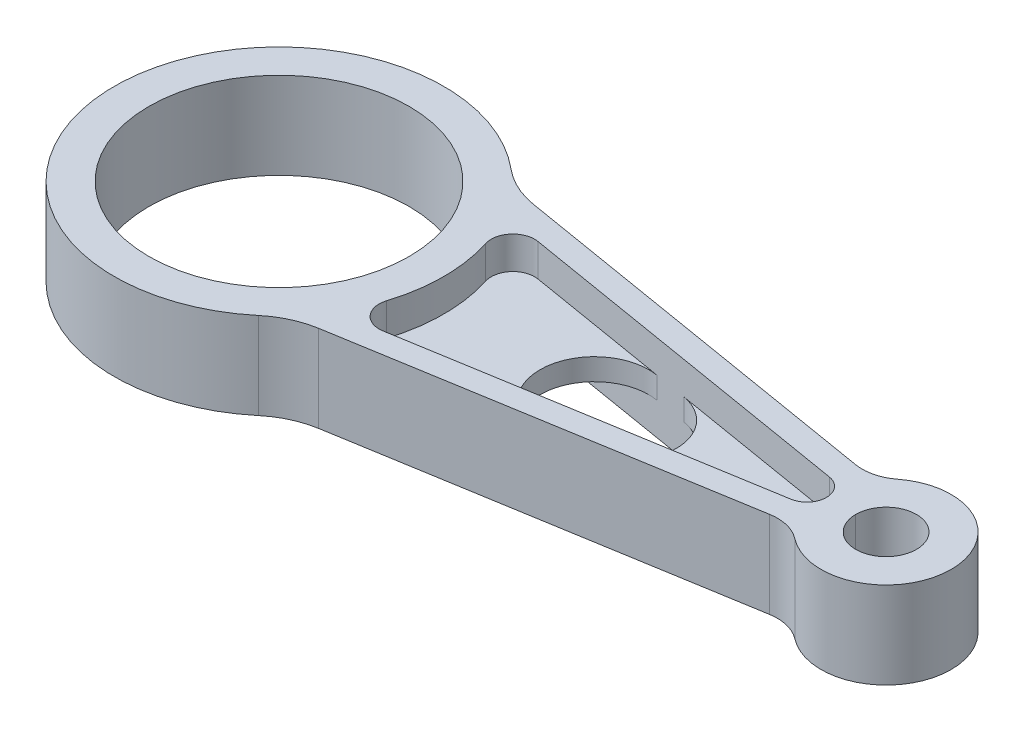
ISO-10303-21;
HEADER;
FILE_DESCRIPTION(('STEP AP214'),'2;1');
FILE_NAME('part.step','',(''),(''),'','','');
FILE_SCHEMA(('AUTOMOTIVE_DESIGN { 1 0 10303 214 1 1 1 1 }'));
ENDSEC;
DATA;
#1=APPLICATION_CONTEXT('core data for automotive mechanical design processes');
#2=APPLICATION_PROTOCOL_DEFINITION('international standard','automotive_design',2000,#1);
#3=PRODUCT_CONTEXT('',#1,'mechanical');
#4=PRODUCT('Part','Part','',(#3));
#5=PRODUCT_RELATED_PRODUCT_CATEGORY('part','',(#4));
#6=PRODUCT_DEFINITION_FORMATION('','',#4);
#7=PRODUCT_DEFINITION_CONTEXT('part definition',#1,'design');
#8=PRODUCT_DEFINITION('design','',#6,#7);
#9=PRODUCT_DEFINITION_SHAPE('','',#8);
#10=(LENGTH_UNIT() NAMED_UNIT(*) SI_UNIT(.MILLI.,.METRE.));
#11=(NAMED_UNIT(*) PLANE_ANGLE_UNIT() SI_UNIT($,.RADIAN.));
#12=(NAMED_UNIT(*) SI_UNIT($,.STERADIAN.) SOLID_ANGLE_UNIT());
#13=UNCERTAINTY_MEASURE_WITH_UNIT(LENGTH_MEASURE(1.E-05),#10,'distance_accuracy_value','');
#14=(GEOMETRIC_REPRESENTATION_CONTEXT(3) GLOBAL_UNCERTAINTY_ASSIGNED_CONTEXT((#13)) GLOBAL_UNIT_ASSIGNED_CONTEXT((#10,
#11,#12)) REPRESENTATION_CONTEXT('',''));
#15=CARTESIAN_POINT('',(0.,0.,0.));
#16=DIRECTION('',(0.,0.,1.));
#17=DIRECTION('',(1.,0.,0.));
#18=AXIS2_PLACEMENT_3D('',#15,#16,#17);
#19=CARTESIAN_POINT('',(41.0071259869049,-2.5,-12.9389187451698));
#20=DIRECTION('',(0.,-1.,0.));
#21=DIRECTION('',(0.,0.,-1.));
#22=AXIS2_PLACEMENT_3D('',#19,#20,#21);
#23=PLANE('',#22);
#24=CARTESIAN_POINT('',(80.3341075420262,-2.5,0.));
#25=DIRECTION('',(0.,-1.,0.));
#26=DIRECTION('',(0.,0.,-1.));
#27=AXIS2_PLACEMENT_3D('',#24,#25,#26);
#28=CIRCLE('',#27,11.3022537609528);
#29=CARTESIAN_POINT('',(82.1909063741827,-2.5,-11.148687733266));
#30=VERTEX_POINT('',#29);
#31=CARTESIAN_POINT('',(82.1909063741827,-2.5,11.148687733266));
#32=VERTEX_POINT('',#31);
#33=EDGE_CURVE('E213',#30,#32,#28,.T.);
#34=ORIENTED_EDGE('',*,*,#33,.F.);
#35=DIRECTION('',(-0.986412795984335,0.,-0.164285714285714));
#36=VECTOR('',#35,1.);
#37=CARTESIAN_POINT('',(41.8285545583335,-2.5,-17.8709827250914));
#38=LINE('',#37,#36);
#39=CARTESIAN_POINT('',(122.478416149068,-2.5,-4.43885758192951));
#40=VERTEX_POINT('',#39);
#41=EDGE_CURVE('E220',#40,#30,#38,.T.);
#42=ORIENTED_EDGE('',*,*,#41,.F.);
#43=CARTESIAN_POINT('',(121.739130434783,-2.5,0.));
#44=DIRECTION('',(0.,1.,0.));
#45=DIRECTION('',(0.,0.,-1.));
#46=AXIS2_PLACEMENT_3D('',#43,#44,#45);
#47=CIRCLE('',#46,4.50000000000001);
#48=CARTESIAN_POINT('',(122.478416149068,-2.5,4.43885758192951));
#49=VERTEX_POINT('',#48);
#50=EDGE_CURVE('E237',#49,#40,#47,.T.);
#51=ORIENTED_EDGE('',*,*,#50,.F.);
#52=DIRECTION('',(0.986412795984335,0.,-0.164285714285714));
#53=VECTOR('',#52,1.);
#54=CARTESIAN_POINT('',(122.478416149068,-2.5,4.43885758192951));
#55=LINE('',#54,#53);
#56=EDGE_CURVE('E222',#32,#49,#55,.T.);
#57=ORIENTED_EDGE('',*,*,#56,.F.);
#58=EDGE_LOOP('',(#34,#42,#51,#57));
#59=FACE_BOUND('',#58,.T.);
#60=ADVANCED_FACE('F41',(#59),#23,.T.);
#61=CARTESIAN_POINT('',(41.0071259869049,2.5,-12.9389187451698));
#62=DIRECTION('',(0.,-1.,0.));
#63=DIRECTION('',(0.,0.,-1.));
#64=AXIS2_PLACEMENT_3D('',#61,#62,#63);
#65=PLANE('',#64);
#66=DIRECTION('',(-0.986412795984335,0.,-0.164285714285714));
#67=VECTOR('',#66,1.);
#68=CARTESIAN_POINT('',(41.8285545583335,2.5,-17.8709827250914));
#69=LINE('',#68,#67);
#70=CARTESIAN_POINT('',(122.478416149068,2.5,-4.43885758192952));
#71=VERTEX_POINT('',#70);
#72=CARTESIAN_POINT('',(82.1909063741827,2.5,-11.148687733266));
#73=VERTEX_POINT('',#72);
#74=EDGE_CURVE('E263',#71,#73,#69,.T.);
#75=ORIENTED_EDGE('',*,*,#74,.T.);
#76=CARTESIAN_POINT('',(80.3341075420262,2.5,0.));
#77=DIRECTION('',(0.,-1.,0.));
#78=DIRECTION('',(0.,0.,-1.));
#79=AXIS2_PLACEMENT_3D('',#76,#77,#78);
#80=CIRCLE('',#79,11.3022537609528);
#81=CARTESIAN_POINT('',(82.1909063741827,2.5,11.148687733266));
#82=VERTEX_POINT('',#81);
#83=EDGE_CURVE('E11',#73,#82,#80,.T.);
#84=ORIENTED_EDGE('',*,*,#83,.T.);
#85=DIRECTION('',(0.986412795984335,0.,-0.164285714285714));
#86=VECTOR('',#85,1.);
#87=CARTESIAN_POINT('',(122.478416149068,2.5,4.43885758192951));
#88=LINE('',#87,#86);
#89=CARTESIAN_POINT('',(122.478416149068,2.5,4.43885758192952));
#90=VERTEX_POINT('',#89);
#91=EDGE_CURVE('E436',#82,#90,#88,.T.);
#92=ORIENTED_EDGE('',*,*,#91,.T.);
#93=CARTESIAN_POINT('',(121.739130434783,2.5,0.));
#94=DIRECTION('',(0.,1.,0.));
#95=DIRECTION('',(0.,0.,-1.));
#96=AXIS2_PLACEMENT_3D('',#93,#94,#95);
#97=CIRCLE('',#96,4.50000000000001);
#98=EDGE_CURVE('E388',#90,#71,#97,.T.);
#99=ORIENTED_EDGE('',*,*,#98,.T.);
#100=EDGE_LOOP('',(#75,#84,#92,#99));
#101=FACE_BOUND('',#100,.T.);
#102=ADVANCED_FACE('F439',(#101),#65,.F.);
#103=CARTESIAN_POINT('',(41.0071259869049,-10.,-12.9389187451698));
#104=DIRECTION('',(0.,1.,0.));
#105=DIRECTION('',(0.,0.,1.));
#106=AXIS2_PLACEMENT_3D('',#103,#104,#105);
#107=CYLINDRICAL_SURFACE('',#106,5.00000000000001);
#108=CARTESIAN_POINT('',(41.0071259869049,2.5,-12.9389187451698));
#109=DIRECTION('',(0.,1.,0.));
#110=DIRECTION('',(0.,0.,-1.));
#111=AXIS2_PLACEMENT_3D('',#108,#109,#110);
#112=CIRCLE('',#111,5.);
#113=CARTESIAN_POINT('',(41.8285545583335,2.5,-17.8709827250915));
#114=VERTEX_POINT('',#113);
#115=CARTESIAN_POINT('',(36.2388555233113,2.5,-11.4343933096849));
#116=VERTEX_POINT('',#115);
#117=EDGE_CURVE('E231',#114,#116,#112,.T.);
#118=ORIENTED_EDGE('',*,*,#117,.F.);
#119=DIRECTION('',(0.,1.,0.));
#120=VECTOR('',#119,1.);
#121=CARTESIAN_POINT('',(41.8285545583335,-10.,-17.8709827250915));
#122=LINE('',#121,#120);
#123=CARTESIAN_POINT('',(41.8285545583335,10.,-17.8709827250915));
#124=VERTEX_POINT('',#123);
#125=EDGE_CURVE('E279',#114,#124,#122,.T.);
#126=ORIENTED_EDGE('',*,*,#125,.T.);
#127=CARTESIAN_POINT('',(41.0071259869049,10.,-12.9389187451698));
#128=DIRECTION('',(0.,1.,0.));
#129=DIRECTION('',(0.,0.,-1.));
#130=AXIS2_PLACEMENT_3D('',#127,#128,#129);
#131=CIRCLE('',#130,5.00000000000001);
#132=CARTESIAN_POINT('',(36.2388555233113,10.,-11.4343933096849));
#133=VERTEX_POINT('',#132);
#134=EDGE_CURVE('E259',#124,#133,#131,.T.);
#135=ORIENTED_EDGE('',*,*,#134,.T.);
#136=DIRECTION('',(0.,1.,0.));
#137=VECTOR('',#136,1.);
#138=CARTESIAN_POINT('',(36.2388555233113,-10.,-11.4343933096849));
#139=LINE('',#138,#137);
#140=EDGE_CURVE('E258',#116,#133,#139,.T.);
#141=ORIENTED_EDGE('',*,*,#140,.F.);
#142=EDGE_LOOP('',(#118,#126,#135,#141));
#143=FACE_BOUND('',#142,.T.);
#144=ADVANCED_FACE('F455',(#143),#107,.F.);
#145=CARTESIAN_POINT('',(121.739130434783,-10.,0.));
#146=DIRECTION('',(0.,1.,0.));
#147=DIRECTION('',(0.,0.,1.));
#148=AXIS2_PLACEMENT_3D('',#145,#146,#147);
#149=CYLINDRICAL_SURFACE('',#148,4.50000000000002);
#150=ORIENTED_EDGE('',*,*,#98,.F.);
#151=DIRECTION('',(0.,1.,0.));
#152=VECTOR('',#151,1.);
#153=CARTESIAN_POINT('',(122.478416149068,-10.,4.43885758192952));
#154=LINE('',#153,#152);
#155=CARTESIAN_POINT('',(122.478416149068,10.,4.43885758192952));
#156=VERTEX_POINT('',#155);
#157=EDGE_CURVE('E285',#90,#156,#154,.T.);
#158=ORIENTED_EDGE('',*,*,#157,.T.);
#159=CARTESIAN_POINT('',(121.739130434783,10.,0.));
#160=DIRECTION('',(0.,1.,0.));
#161=DIRECTION('',(0.,0.,-1.));
#162=AXIS2_PLACEMENT_3D('',#159,#160,#161);
#163=CIRCLE('',#162,4.50000000000002);
#164=CARTESIAN_POINT('',(122.478416149068,10.,-4.43885758192952));
#165=VERTEX_POINT('',#164);
#166=EDGE_CURVE('E271',#156,#165,#163,.T.);
#167=ORIENTED_EDGE('',*,*,#166,.T.);
#168=DIRECTION('',(0.,1.,0.));
#169=VECTOR('',#168,1.);
#170=CARTESIAN_POINT('',(122.478416149068,-10.,-4.43885758192952));
#171=LINE('',#170,#169);
#172=EDGE_CURVE('E281',#71,#165,#171,.T.);
#173=ORIENTED_EDGE('',*,*,#172,.F.);
#174=EDGE_LOOP('',(#150,#158,#167,#173));
#175=FACE_BOUND('',#174,.T.);
#176=ADVANCED_FACE('F444',(#175),#149,.F.);
#177=CARTESIAN_POINT('',(41.0071259869049,-10.,12.9389187451698));
#178=DIRECTION('',(0.,1.,0.));
#179=DIRECTION('',(0.,0.,1.));
#180=AXIS2_PLACEMENT_3D('',#177,#178,#179);
#181=CYLINDRICAL_SURFACE('',#180,5.00000000000001);
#182=CARTESIAN_POINT('',(41.0071259869049,2.5,12.9389187451698));
#183=DIRECTION('',(0.,1.,0.));
#184=DIRECTION('',(0.,0.,1.));
#185=AXIS2_PLACEMENT_3D('',#182,#183,#184);
#186=CIRCLE('',#185,5.);
#187=CARTESIAN_POINT('',(36.2388555233113,2.5,11.4343933096849));
#188=VERTEX_POINT('',#187);
#189=CARTESIAN_POINT('',(41.8285545583335,2.5,17.8709827250915));
#190=VERTEX_POINT('',#189);
#191=EDGE_CURVE('E435',#188,#190,#186,.T.);
#192=ORIENTED_EDGE('',*,*,#191,.F.);
#193=DIRECTION('',(0.,1.,0.));
#194=VECTOR('',#193,1.);
#195=CARTESIAN_POINT('',(36.2388555233113,-10.,11.4343933096849));
#196=LINE('',#195,#194);
#197=CARTESIAN_POINT('',(36.2388555233113,10.,11.4343933096849));
#198=VERTEX_POINT('',#197);
#199=EDGE_CURVE('E293',#188,#198,#196,.T.);
#200=ORIENTED_EDGE('',*,*,#199,.T.);
#201=CARTESIAN_POINT('',(41.0071259869049,10.,12.9389187451698));
#202=DIRECTION('',(0.,1.,0.));
#203=DIRECTION('',(0.,0.,1.));
#204=AXIS2_PLACEMENT_3D('',#201,#202,#203);
#205=CIRCLE('',#204,5.00000000000001);
#206=CARTESIAN_POINT('',(41.8285545583335,10.,17.8709827250915));
#207=VERTEX_POINT('',#206);
#208=EDGE_CURVE('E266',#198,#207,#205,.T.);
#209=ORIENTED_EDGE('',*,*,#208,.T.);
#210=DIRECTION('',(0.,1.,0.));
#211=VECTOR('',#210,1.);
#212=CARTESIAN_POINT('',(41.8285545583335,-10.,17.8709827250915));
#213=LINE('',#212,#211);
#214=EDGE_CURVE('E289',#190,#207,#213,.T.);
#215=ORIENTED_EDGE('',*,*,#214,.F.);
#216=EDGE_LOOP('',(#192,#200,#209,#215));
#217=FACE_BOUND('',#216,.T.);
#218=ADVANCED_FACE('F461',(#217),#181,.F.);
#219=CARTESIAN_POINT('',(0.,-10.,0.));
#220=DIRECTION('',(0.,1.,0.));
#221=DIRECTION('',(0.,0.,1.));
#222=AXIS2_PLACEMENT_3D('',#219,#220,#221);
#223=CYLINDRICAL_SURFACE('',#222,38.);
#224=CARTESIAN_POINT('',(0.,2.5,0.));
#225=DIRECTION('',(0.,-1.,0.));
#226=DIRECTION('',(0.,0.,-1.));
#227=AXIS2_PLACEMENT_3D('',#224,#225,#226);
#228=CIRCLE('',#227,38.);
#229=EDGE_CURVE('E235',#116,#188,#228,.T.);
#230=ORIENTED_EDGE('',*,*,#229,.F.);
#231=ORIENTED_EDGE('',*,*,#140,.T.);
#232=CARTESIAN_POINT('',(0.,10.,0.));
#233=DIRECTION('',(0.,-1.,0.));
#234=DIRECTION('',(0.,0.,-1.));
#235=AXIS2_PLACEMENT_3D('',#232,#233,#234);
#236=CIRCLE('',#235,38.);
#237=EDGE_CURVE('E262',#133,#198,#236,.T.);
#238=ORIENTED_EDGE('',*,*,#237,.T.);
#239=ORIENTED_EDGE('',*,*,#199,.F.);
#240=EDGE_LOOP('',(#230,#231,#238,#239));
#241=FACE_BOUND('',#240,.T.);
#242=ADVANCED_FACE('F459',(#241),#223,.T.);
#243=CARTESIAN_POINT('',(0.,10.,0.));
#244=DIRECTION('',(0.,1.,0.));
#245=DIRECTION('',(0.,0.,1.));
#246=AXIS2_PLACEMENT_3D('',#243,#244,#245);
#247=PLANE('',#246);
#248=CARTESIAN_POINT('',(140.,10.,0.));
#249=DIRECTION('',(0.,1.,0.));
#250=DIRECTION('',(0.,0.,1.));
#251=AXIS2_PLACEMENT_3D('',#248,#249,#250);
#252=CIRCLE('',#251,7.00000000000001);
#253=CARTESIAN_POINT('',(147.,10.,0.));
#254=VERTEX_POINT('',#253);
#255=CARTESIAN_POINT('',(133.,10.,0.));
#256=VERTEX_POINT('',#255);
#257=EDGE_CURVE('E297',#254,#256,#252,.T.);
#258=ORIENTED_EDGE('',*,*,#257,.F.);
#259=EDGE_CURVE('E301',#256,#254,#252,.T.);
#260=ORIENTED_EDGE('',*,*,#259,.F.);
#261=EDGE_LOOP('',(#258,#260));
#262=FACE_BOUND('',#261,.T.);
#263=DIRECTION('',(-0.986412795984335,0.,-0.164285714285714));
#264=VECTOR('',#263,1.);
#265=CARTESIAN_POINT('',(27.9354736759495,10.,-25.7606154914888));
#266=LINE('',#265,#264);
#267=CARTESIAN_POINT('',(123.068754783715,10.,-9.91629645714703));
#268=VERTEX_POINT('',#267);
#269=CARTESIAN_POINT('',(33.9230677395359,10.,-24.7633898151861));
#270=VERTEX_POINT('',#269);
#271=EDGE_CURVE('E320',#268,#270,#266,.T.);
#272=ORIENTED_EDGE('',*,*,#271,.T.);
#273=CARTESIAN_POINT('',(37.2087820252502,10.,-44.4916457348727));
#274=DIRECTION('',(0.,1.,0.));
#275=DIRECTION('',(0.,0.,1.));
#276=AXIS2_PLACEMENT_3D('',#273,#274,#275);
#277=CIRCLE('',#276,20.);
#278=CARTESIAN_POINT('',(24.3781675337846,10.,-29.1496989297442));
#279=VERTEX_POINT('',#278);
#280=EDGE_CURVE('E368',#270,#279,#277,.F.);
#281=ORIENTED_EDGE('',*,*,#280,.T.);
#282=CARTESIAN_POINT('',(0.,10.,0.));
#283=DIRECTION('',(0.,1.,0.));
#284=DIRECTION('',(0.,0.,1.));
#285=AXIS2_PLACEMENT_3D('',#282,#283,#284);
#286=CIRCLE('',#285,38.);
#287=CARTESIAN_POINT('',(24.3781675337846,10.,29.1496989297442));
#288=VERTEX_POINT('',#287);
#289=EDGE_CURVE('E311',#279,#288,#286,.T.);
#290=ORIENTED_EDGE('',*,*,#289,.T.);
#291=CARTESIAN_POINT('',(37.2087820252501,10.,44.4916457348728));
#292=DIRECTION('',(0.,1.,0.));
#293=DIRECTION('',(0.,0.,1.));
#294=AXIS2_PLACEMENT_3D('',#291,#292,#293);
#295=CIRCLE('',#294,20.);
#296=CARTESIAN_POINT('',(33.9230677395358,10.,24.7633898151861));
#297=VERTEX_POINT('',#296);
#298=EDGE_CURVE('E364',#288,#297,#295,.F.);
#299=ORIENTED_EDGE('',*,*,#298,.T.);
#300=DIRECTION('',(0.986412795984335,0.,-0.164285714285714));
#301=VECTOR('',#300,1.);
#302=CARTESIAN_POINT('',(128.063755469258,10.,9.08438586269532));
#303=LINE('',#302,#301);
#304=CARTESIAN_POINT('',(123.068754783715,10.,9.91629645714704));
#305=VERTEX_POINT('',#304);
#306=EDGE_CURVE('E314',#297,#305,#303,.T.);
#307=ORIENTED_EDGE('',*,*,#306,.T.);
#308=CARTESIAN_POINT('',(124.711611926572,10.,19.7804244169904));
#309=DIRECTION('',(0.,1.,0.));
#310=DIRECTION('',(0.,0.,1.));
#311=AXIS2_PLACEMENT_3D('',#308,#309,#310);
#312=CIRCLE('',#311,10.);
#313=CARTESIAN_POINT('',(130.826967155943,10.,11.8682546501942));
#314=VERTEX_POINT('',#313);
#315=EDGE_CURVE('E346',#305,#314,#312,.F.);
#316=ORIENTED_EDGE('',*,*,#315,.T.);
#317=CARTESIAN_POINT('',(140.,10.,0.));
#318=DIRECTION('',(0.,1.,0.));
#319=DIRECTION('',(0.,0.,1.));
#320=AXIS2_PLACEMENT_3D('',#317,#318,#319);
#321=CIRCLE('',#320,15.);
#322=CARTESIAN_POINT('',(130.826967155943,10.,-11.8682546501942));
#323=VERTEX_POINT('',#322);
#324=EDGE_CURVE('E317',#314,#323,#321,.T.);
#325=ORIENTED_EDGE('',*,*,#324,.T.);
#326=CARTESIAN_POINT('',(124.711611926572,10.,-19.7804244169904));
#327=DIRECTION('',(0.,1.,0.));
#328=DIRECTION('',(0.,0.,1.));
#329=AXIS2_PLACEMENT_3D('',#326,#327,#328);
#330=CIRCLE('',#329,10.);
#331=EDGE_CURVE('E350',#323,#268,#330,.F.);
#332=ORIENTED_EDGE('',*,*,#331,.T.);
#333=EDGE_LOOP('',(#272,#281,#290,#299,#307,#316,#325,#332));
#334=FACE_BOUND('',#333,.T.);
#335=CARTESIAN_POINT('',(0.,10.,0.));
#336=DIRECTION('',(0.,1.,0.));
#337=DIRECTION('',(0.,0.,1.));
#338=AXIS2_PLACEMENT_3D('',#335,#336,#337);
#339=CIRCLE('',#338,30.);
#340=CARTESIAN_POINT('',(0.,10.,30.));
#341=VERTEX_POINT('',#340);
#342=EDGE_CURVE('E305',#341,#341,#339,.T.);
#343=ORIENTED_EDGE('',*,*,#342,.F.);
#344=EDGE_LOOP('',(#343));
#345=FACE_BOUND('',#344,.T.);
#346=ORIENTED_EDGE('',*,*,#134,.F.);
#347=DIRECTION('',(-0.986412795984335,0.,-0.164285714285714));
#348=VECTOR('',#347,1.);
#349=CARTESIAN_POINT('',(41.8285545583335,10.,-17.8709827250915));
#350=LINE('',#349,#348);
#351=EDGE_CURVE('E245',#165,#124,#350,.T.);
#352=ORIENTED_EDGE('',*,*,#351,.F.);
#353=ORIENTED_EDGE('',*,*,#166,.F.);
#354=DIRECTION('',(0.986412795984335,0.,-0.164285714285714));
#355=VECTOR('',#354,1.);
#356=CARTESIAN_POINT('',(122.478416149068,10.,4.43885758192952));
#357=LINE('',#356,#355);
#358=EDGE_CURVE('E269',#207,#156,#357,.T.);
#359=ORIENTED_EDGE('',*,*,#358,.F.);
#360=ORIENTED_EDGE('',*,*,#208,.F.);
#361=ORIENTED_EDGE('',*,*,#237,.F.);
#362=EDGE_LOOP('',(#346,#352,#353,#359,#360,#361));
#363=FACE_BOUND('',#362,.T.);
#364=ADVANCED_FACE('F451',(#262,#334,#345,#363),#247,.T.);
#365=CARTESIAN_POINT('',(0.,-10.,0.));
#366=DIRECTION('',(0.,1.,0.));
#367=DIRECTION('',(0.,0.,1.));
#368=AXIS2_PLACEMENT_3D('',#365,#366,#367);
#369=PLANE('',#368);
#370=CARTESIAN_POINT('',(0.,-10.,0.));
#371=DIRECTION('',(0.,1.,0.));
#372=DIRECTION('',(0.,0.,1.));
#373=AXIS2_PLACEMENT_3D('',#370,#371,#372);
#374=CIRCLE('',#373,38.);
#375=CARTESIAN_POINT('',(24.3781675337846,-10.,-29.1496989297442));
#376=VERTEX_POINT('',#375);
#377=CARTESIAN_POINT('',(24.3781675337846,-10.,29.1496989297442));
#378=VERTEX_POINT('',#377);
#379=EDGE_CURVE('E308',#376,#378,#374,.T.);
#380=ORIENTED_EDGE('',*,*,#379,.F.);
#381=CARTESIAN_POINT('',(37.2087820252502,-10.,-44.4916457348727));
#382=DIRECTION('',(0.,1.,0.));
#383=DIRECTION('',(0.,0.,1.));
#384=AXIS2_PLACEMENT_3D('',#381,#382,#383);
#385=CIRCLE('',#384,20.);
#386=CARTESIAN_POINT('',(33.9230677395359,-10.,-24.7633898151861));
#387=VERTEX_POINT('',#386);
#388=EDGE_CURVE('E366',#376,#387,#385,.T.);
#389=ORIENTED_EDGE('',*,*,#388,.T.);
#390=DIRECTION('',(-0.986412795984335,0.,-0.164285714285714));
#391=VECTOR('',#390,1.);
#392=CARTESIAN_POINT('',(27.9354736759495,-10.,-25.7606154914888));
#393=LINE('',#392,#391);
#394=CARTESIAN_POINT('',(123.068754783715,-10.,-9.91629645714703));
#395=VERTEX_POINT('',#394);
#396=EDGE_CURVE('E315',#395,#387,#393,.T.);
#397=ORIENTED_EDGE('',*,*,#396,.F.);
#398=CARTESIAN_POINT('',(124.711611926572,-10.,-19.7804244169904));
#399=DIRECTION('',(0.,1.,0.));
#400=DIRECTION('',(0.,0.,1.));
#401=AXIS2_PLACEMENT_3D('',#398,#399,#400);
#402=CIRCLE('',#401,10.);
#403=CARTESIAN_POINT('',(130.826967155943,-10.,-11.8682546501942));
#404=VERTEX_POINT('',#403);
#405=EDGE_CURVE('E348',#395,#404,#402,.T.);
#406=ORIENTED_EDGE('',*,*,#405,.T.);
#407=CARTESIAN_POINT('',(140.,-10.,0.));
#408=DIRECTION('',(0.,1.,0.));
#409=DIRECTION('',(0.,0.,1.));
#410=AXIS2_PLACEMENT_3D('',#407,#408,#409);
#411=CIRCLE('',#410,15.);
#412=CARTESIAN_POINT('',(130.826967155943,-10.,11.8682546501942));
#413=VERTEX_POINT('',#412);
#414=EDGE_CURVE('E328',#413,#404,#411,.T.);
#415=ORIENTED_EDGE('',*,*,#414,.F.);
#416=CARTESIAN_POINT('',(124.711611926572,-10.,19.7804244169904));
#417=DIRECTION('',(0.,1.,0.));
#418=DIRECTION('',(0.,0.,1.));
#419=AXIS2_PLACEMENT_3D('',#416,#417,#418);
#420=CIRCLE('',#419,10.);
#421=CARTESIAN_POINT('',(123.068754783715,-10.,9.91629645714704));
#422=VERTEX_POINT('',#421);
#423=EDGE_CURVE('E343',#413,#422,#420,.T.);
#424=ORIENTED_EDGE('',*,*,#423,.T.);
#425=DIRECTION('',(0.986412795984335,0.,-0.164285714285714));
#426=VECTOR('',#425,1.);
#427=CARTESIAN_POINT('',(128.063755469258,-10.,9.08438586269532));
#428=LINE('',#427,#426);
#429=CARTESIAN_POINT('',(33.9230677395358,-10.,24.7633898151861));
#430=VERTEX_POINT('',#429);
#431=EDGE_CURVE('E326',#430,#422,#428,.T.);
#432=ORIENTED_EDGE('',*,*,#431,.F.);
#433=CARTESIAN_POINT('',(37.2087820252501,-10.,44.4916457348728));
#434=DIRECTION('',(0.,1.,0.));
#435=DIRECTION('',(0.,0.,1.));
#436=AXIS2_PLACEMENT_3D('',#433,#434,#435);
#437=CIRCLE('',#436,20.);
#438=EDGE_CURVE('E362',#430,#378,#437,.T.);
#439=ORIENTED_EDGE('',*,*,#438,.T.);
#440=EDGE_LOOP('',(#380,#389,#397,#406,#415,#424,#432,#439));
#441=FACE_BOUND('',#440,.T.);
#442=CARTESIAN_POINT('',(0.,-10.,0.));
#443=DIRECTION('',(0.,1.,0.));
#444=DIRECTION('',(0.,0.,1.));
#445=AXIS2_PLACEMENT_3D('',#442,#443,#444);
#446=CIRCLE('',#445,30.);
#447=CARTESIAN_POINT('',(0.,-10.,30.));
#448=VERTEX_POINT('',#447);
#449=EDGE_CURVE('E300',#448,#448,#446,.T.);
#450=ORIENTED_EDGE('',*,*,#449,.T.);
#451=EDGE_LOOP('',(#450));
#452=FACE_BOUND('',#451,.T.);
#453=CARTESIAN_POINT('',(140.,-10.,0.));
#454=DIRECTION('',(0.,1.,0.));
#455=DIRECTION('',(0.,0.,1.));
#456=AXIS2_PLACEMENT_3D('',#453,#454,#455);
#457=CIRCLE('',#456,7.00000000000001);
#458=CARTESIAN_POINT('',(147.,-10.,0.));
#459=VERTEX_POINT('',#458);
#460=CARTESIAN_POINT('',(133.,-10.,0.));
#461=VERTEX_POINT('',#460);
#462=EDGE_CURVE('E302',#459,#461,#457,.T.);
#463=ORIENTED_EDGE('',*,*,#462,.T.);
#464=EDGE_CURVE('E278',#461,#459,#457,.T.);
#465=ORIENTED_EDGE('',*,*,#464,.T.);
#466=EDGE_LOOP('',(#463,#465));
#467=FACE_BOUND('',#466,.T.);
#468=DIRECTION('',(-0.986412795984335,0.,-0.164285714285714));
#469=VECTOR('',#468,1.);
#470=CARTESIAN_POINT('',(41.8285545583335,-10.,-17.8709827250915));
#471=LINE('',#470,#469);
#472=CARTESIAN_POINT('',(122.478416149068,-10.,-4.43885758192952));
#473=VERTEX_POINT('',#472);
#474=CARTESIAN_POINT('',(41.8285545583335,-10.,-17.8709827250915));
#475=VERTEX_POINT('',#474);
#476=EDGE_CURVE('E256',#473,#475,#471,.T.);
#477=ORIENTED_EDGE('',*,*,#476,.T.);
#478=CARTESIAN_POINT('',(41.0071259869049,-10.,-12.9389187451698));
#479=DIRECTION('',(0.,1.,0.));
#480=DIRECTION('',(0.,0.,-1.));
#481=AXIS2_PLACEMENT_3D('',#478,#479,#480);
#482=CIRCLE('',#481,5.00000000000001);
#483=CARTESIAN_POINT('',(36.2388555233113,-10.,-11.4343933096849));
#484=VERTEX_POINT('',#483);
#485=EDGE_CURVE('E241',#475,#484,#482,.T.);
#486=ORIENTED_EDGE('',*,*,#485,.T.);
#487=CARTESIAN_POINT('',(0.,-10.,0.));
#488=DIRECTION('',(0.,-1.,0.));
#489=DIRECTION('',(0.,0.,-1.));
#490=AXIS2_PLACEMENT_3D('',#487,#488,#489);
#491=CIRCLE('',#490,38.);
#492=CARTESIAN_POINT('',(36.2388555233113,-10.,11.4343933096849));
#493=VERTEX_POINT('',#492);
#494=EDGE_CURVE('E244',#484,#493,#491,.T.);
#495=ORIENTED_EDGE('',*,*,#494,.T.);
#496=CARTESIAN_POINT('',(41.0071259869049,-10.,12.9389187451698));
#497=DIRECTION('',(0.,1.,0.));
#498=DIRECTION('',(0.,0.,1.));
#499=AXIS2_PLACEMENT_3D('',#496,#497,#498);
#500=CIRCLE('',#499,5.00000000000001);
#501=CARTESIAN_POINT('',(41.8285545583335,-10.,17.8709827250915));
#502=VERTEX_POINT('',#501);
#503=EDGE_CURVE('E248',#493,#502,#500,.T.);
#504=ORIENTED_EDGE('',*,*,#503,.T.);
#505=DIRECTION('',(0.986412795984335,0.,-0.164285714285714));
#506=VECTOR('',#505,1.);
#507=CARTESIAN_POINT('',(122.478416149068,-10.,4.43885758192952));
#508=LINE('',#507,#506);
#509=CARTESIAN_POINT('',(122.478416149068,-10.,4.43885758192952));
#510=VERTEX_POINT('',#509);
#511=EDGE_CURVE('E251',#502,#510,#508,.T.);
#512=ORIENTED_EDGE('',*,*,#511,.T.);
#513=CARTESIAN_POINT('',(121.739130434783,-10.,0.));
#514=DIRECTION('',(0.,1.,0.));
#515=DIRECTION('',(0.,0.,-1.));
#516=AXIS2_PLACEMENT_3D('',#513,#514,#515);
#517=CIRCLE('',#516,4.50000000000002);
#518=EDGE_CURVE('E253',#510,#473,#517,.T.);
#519=ORIENTED_EDGE('',*,*,#518,.T.);
#520=EDGE_LOOP('',(#477,#486,#495,#504,#512,#519));
#521=FACE_BOUND('',#520,.T.);
#522=ADVANCED_FACE('F413',(#441,#452,#467,#521),#369,.F.);
#523=CARTESIAN_POINT('',(140.,10.,0.));
#524=DIRECTION('',(0.,-1.,0.));
#525=DIRECTION('',(0.,0.,-1.));
#526=AXIS2_PLACEMENT_3D('',#523,#524,#525);
#527=CYLINDRICAL_SURFACE('',#526,7.00000000000001);
#528=ORIENTED_EDGE('',*,*,#257,.T.);
#529=DIRECTION('',(0.,-1.,0.));
#530=VECTOR('',#529,1.);
#531=CARTESIAN_POINT('',(133.,10.,0.));
#532=LINE('',#531,#530);
#533=EDGE_CURVE('E374',#256,#461,#532,.T.);
#534=ORIENTED_EDGE('',*,*,#533,.T.);
#535=ORIENTED_EDGE('',*,*,#462,.F.);
#536=DIRECTION('',(0.,1.,0.));
#537=VECTOR('',#536,1.);
#538=CARTESIAN_POINT('',(147.,10.,0.));
#539=LINE('',#538,#537);
#540=EDGE_CURVE('E370',#459,#254,#539,.T.);
#541=ORIENTED_EDGE('',*,*,#540,.T.);
#542=EDGE_LOOP('',(#528,#534,#535,#541));
#543=FACE_BOUND('',#542,.T.);
#544=ADVANCED_FACE('F495',(#543),#527,.F.);
#545=CARTESIAN_POINT('',(0.,10.,0.));
#546=DIRECTION('',(0.,-1.,0.));
#547=DIRECTION('',(0.,0.,-1.));
#548=AXIS2_PLACEMENT_3D('',#545,#546,#547);
#549=CYLINDRICAL_SURFACE('',#548,38.);
#550=ORIENTED_EDGE('',*,*,#379,.T.);
#551=DIRECTION('',(0.,-1.,0.));
#552=VECTOR('',#551,1.);
#553=CARTESIAN_POINT('',(24.3781675337846,10.,29.1496989297442));
#554=LINE('',#553,#552);
#555=EDGE_CURVE('E358',#378,#288,#554,.F.);
#556=ORIENTED_EDGE('',*,*,#555,.T.);
#557=ORIENTED_EDGE('',*,*,#289,.F.);
#558=DIRECTION('',(0.,-1.,0.));
#559=VECTOR('',#558,1.);
#560=CARTESIAN_POINT('',(24.3781675337846,10.,-29.1496989297442));
#561=LINE('',#560,#559);
#562=EDGE_CURVE('E355',#279,#376,#561,.T.);
#563=ORIENTED_EDGE('',*,*,#562,.T.);
#564=EDGE_LOOP('',(#550,#556,#557,#563));
#565=FACE_BOUND('',#564,.T.);
#566=ADVANCED_FACE('F516',(#565),#549,.T.);
#567=CARTESIAN_POINT('',(128.063755469258,10.,9.08438586269532));
#568=DIRECTION('',(-0.164285714285714,0.,-0.986412795984335));
#569=DIRECTION('',(-0.986412795984335,0.,0.164285714285714));
#570=AXIS2_PLACEMENT_3D('',#567,#568,#569);
#571=PLANE('',#570);
#572=ORIENTED_EDGE('',*,*,#306,.F.);
#573=DIRECTION('',(0.,1.,0.));
#574=VECTOR('',#573,1.);
#575=CARTESIAN_POINT('',(33.9230677395358,-10.,24.7633898151861));
#576=LINE('',#575,#574);
#577=EDGE_CURVE('E352',#297,#430,#576,.F.);
#578=ORIENTED_EDGE('',*,*,#577,.T.);
#579=ORIENTED_EDGE('',*,*,#431,.T.);
#580=DIRECTION('',(0.,1.,0.));
#581=VECTOR('',#580,1.);
#582=CARTESIAN_POINT('',(123.068754783715,10.,9.91629645714704));
#583=LINE('',#582,#581);
#584=EDGE_CURVE('E337',#422,#305,#583,.T.);
#585=ORIENTED_EDGE('',*,*,#584,.T.);
#586=EDGE_LOOP('',(#572,#578,#579,#585));
#587=FACE_BOUND('',#586,.T.);
#588=ADVANCED_FACE('F512',(#587),#571,.F.);
#589=CARTESIAN_POINT('',(140.,10.,0.));
#590=DIRECTION('',(0.,-1.,0.));
#591=DIRECTION('',(0.,0.,-1.));
#592=AXIS2_PLACEMENT_3D('',#589,#590,#591);
#593=CYLINDRICAL_SURFACE('',#592,15.);
#594=ORIENTED_EDGE('',*,*,#324,.F.);
#595=DIRECTION('',(0.,-1.,0.));
#596=VECTOR('',#595,1.);
#597=CARTESIAN_POINT('',(130.826967155943,10.,11.8682546501942));
#598=LINE('',#597,#596);
#599=EDGE_CURVE('E334',#314,#413,#598,.T.);
#600=ORIENTED_EDGE('',*,*,#599,.T.);
#601=ORIENTED_EDGE('',*,*,#414,.T.);
#602=DIRECTION('',(0.,-1.,0.));
#603=VECTOR('',#602,1.);
#604=CARTESIAN_POINT('',(130.826967155943,10.,-11.8682546501942));
#605=LINE('',#604,#603);
#606=EDGE_CURVE('E323',#404,#323,#605,.F.);
#607=ORIENTED_EDGE('',*,*,#606,.T.);
#608=EDGE_LOOP('',(#594,#600,#601,#607));
#609=FACE_BOUND('',#608,.T.);
#610=ADVANCED_FACE('F508',(#609),#593,.T.);
#611=CARTESIAN_POINT('',(27.9354736759495,10.,-25.7606154914888));
#612=DIRECTION('',(-0.164285714285714,0.,0.986412795984335));
#613=DIRECTION('',(0.986412795984335,0.,0.164285714285714));
#614=AXIS2_PLACEMENT_3D('',#611,#612,#613);
#615=PLANE('',#614);
#616=ORIENTED_EDGE('',*,*,#396,.T.);
#617=DIRECTION('',(0.,1.,0.));
#618=VECTOR('',#617,1.);
#619=CARTESIAN_POINT('',(33.9230677395359,10.,-24.7633898151861));
#620=LINE('',#619,#618);
#621=EDGE_CURVE('E360',#387,#270,#620,.T.);
#622=ORIENTED_EDGE('',*,*,#621,.T.);
#623=ORIENTED_EDGE('',*,*,#271,.F.);
#624=DIRECTION('',(0.,1.,0.));
#625=VECTOR('',#624,1.);
#626=CARTESIAN_POINT('',(123.068754783715,-10.,-9.91629645714703));
#627=LINE('',#626,#625);
#628=EDGE_CURVE('E340',#268,#395,#627,.F.);
#629=ORIENTED_EDGE('',*,*,#628,.T.);
#630=EDGE_LOOP('',(#616,#622,#623,#629));
#631=FACE_BOUND('',#630,.T.);
#632=ADVANCED_FACE('F498',(#631),#615,.F.);
#633=CARTESIAN_POINT('',(0.,10.,0.));
#634=DIRECTION('',(0.,-1.,0.));
#635=DIRECTION('',(0.,0.,-1.));
#636=AXIS2_PLACEMENT_3D('',#633,#634,#635);
#637=CYLINDRICAL_SURFACE('',#636,30.);
#638=ORIENTED_EDGE('',*,*,#342,.T.);
#639=EDGE_LOOP('',(#638));
#640=FACE_BOUND('',#639,.T.);
#641=ORIENTED_EDGE('',*,*,#449,.F.);
#642=EDGE_LOOP('',(#641));
#643=FACE_BOUND('',#642,.T.);
#644=ADVANCED_FACE('F493',(#640,#643),#637,.F.);
#645=ORIENTED_EDGE('',*,*,#533,.F.);
#646=ORIENTED_EDGE('',*,*,#259,.T.);
#647=ORIENTED_EDGE('',*,*,#540,.F.);
#648=ORIENTED_EDGE('',*,*,#464,.F.);
#649=EDGE_LOOP('',(#645,#646,#647,#648));
#650=FACE_BOUND('',#649,.T.);
#651=ADVANCED_FACE('F489',(#650),#527,.F.);
#652=CARTESIAN_POINT('',(124.711611926572,10.,19.7804244169904));
#653=DIRECTION('',(0.,-1.,0.));
#654=DIRECTION('',(0.,0.,-1.));
#655=AXIS2_PLACEMENT_3D('',#652,#653,#654);
#656=CYLINDRICAL_SURFACE('',#655,10.);
#657=ORIENTED_EDGE('',*,*,#315,.F.);
#658=ORIENTED_EDGE('',*,*,#584,.F.);
#659=ORIENTED_EDGE('',*,*,#423,.F.);
#660=ORIENTED_EDGE('',*,*,#599,.F.);
#661=EDGE_LOOP('',(#657,#658,#659,#660));
#662=FACE_BOUND('',#661,.T.);
#663=ADVANCED_FACE('F492',(#662),#656,.F.);
#664=CARTESIAN_POINT('',(124.711611926572,10.,-19.7804244169904));
#665=DIRECTION('',(0.,-1.,0.));
#666=DIRECTION('',(0.,0.,-1.));
#667=AXIS2_PLACEMENT_3D('',#664,#665,#666);
#668=CYLINDRICAL_SURFACE('',#667,10.);
#669=ORIENTED_EDGE('',*,*,#331,.F.);
#670=ORIENTED_EDGE('',*,*,#606,.F.);
#671=ORIENTED_EDGE('',*,*,#405,.F.);
#672=ORIENTED_EDGE('',*,*,#628,.F.);
#673=EDGE_LOOP('',(#669,#670,#671,#672));
#674=FACE_BOUND('',#673,.T.);
#675=ADVANCED_FACE('F523',(#674),#668,.F.);
#676=CARTESIAN_POINT('',(37.2087820252501,10.,44.4916457348728));
#677=DIRECTION('',(0.,-1.,0.));
#678=DIRECTION('',(0.,0.,-1.));
#679=AXIS2_PLACEMENT_3D('',#676,#677,#678);
#680=CYLINDRICAL_SURFACE('',#679,20.);
#681=ORIENTED_EDGE('',*,*,#298,.F.);
#682=ORIENTED_EDGE('',*,*,#555,.F.);
#683=ORIENTED_EDGE('',*,*,#438,.F.);
#684=ORIENTED_EDGE('',*,*,#577,.F.);
#685=EDGE_LOOP('',(#681,#682,#683,#684));
#686=FACE_BOUND('',#685,.T.);
#687=ADVANCED_FACE('F526',(#686),#680,.F.);
#688=CARTESIAN_POINT('',(37.2087820252502,10.,-44.4916457348727));
#689=DIRECTION('',(0.,-1.,0.));
#690=DIRECTION('',(0.,0.,-1.));
#691=AXIS2_PLACEMENT_3D('',#688,#689,#690);
#692=CYLINDRICAL_SURFACE('',#691,20.);
#693=ORIENTED_EDGE('',*,*,#280,.F.);
#694=ORIENTED_EDGE('',*,*,#621,.F.);
#695=ORIENTED_EDGE('',*,*,#388,.F.);
#696=ORIENTED_EDGE('',*,*,#562,.F.);
#697=EDGE_LOOP('',(#693,#694,#695,#696));
#698=FACE_BOUND('',#697,.T.);
#699=ADVANCED_FACE('F43',(#698),#692,.F.);
#700=CARTESIAN_POINT('',(41.8285545583335,-2.5,-17.8709827250914));
#701=VERTEX_POINT('',#700);
#702=EDGE_CURVE('E275',#475,#701,#122,.T.);
#703=ORIENTED_EDGE('',*,*,#702,.T.);
#704=CARTESIAN_POINT('',(41.0071259869049,-2.5,-12.9389187451698));
#705=DIRECTION('',(0.,1.,0.));
#706=DIRECTION('',(0.,0.,-1.));
#707=AXIS2_PLACEMENT_3D('',#704,#705,#706);
#708=CIRCLE('',#707,5.);
#709=CARTESIAN_POINT('',(36.2388555233113,-2.5,-11.4343933096849));
#710=VERTEX_POINT('',#709);
#711=EDGE_CURVE('E223',#701,#710,#708,.T.);
#712=ORIENTED_EDGE('',*,*,#711,.T.);
#713=EDGE_CURVE('E294',#484,#710,#139,.T.);
#714=ORIENTED_EDGE('',*,*,#713,.F.);
#715=ORIENTED_EDGE('',*,*,#485,.F.);
#716=EDGE_LOOP('',(#703,#712,#714,#715));
#717=FACE_BOUND('',#716,.T.);
#718=ADVANCED_FACE('F426',(#717),#107,.F.);
#719=CARTESIAN_POINT('',(41.8285545583335,-10.,-17.8709827250915));
#720=DIRECTION('',(0.164285714285714,0.,-0.986412795984335));
#721=DIRECTION('',(-0.986412795984335,0.,-0.164285714285714));
#722=AXIS2_PLACEMENT_3D('',#719,#720,#721);
#723=PLANE('',#722);
#724=ORIENTED_EDGE('',*,*,#702,.F.);
#725=ORIENTED_EDGE('',*,*,#476,.F.);
#726=EDGE_CURVE('E230',#473,#40,#171,.T.);
#727=ORIENTED_EDGE('',*,*,#726,.T.);
#728=ORIENTED_EDGE('',*,*,#41,.T.);
#729=DIRECTION('',(0.,1.,0.));
#730=VECTOR('',#729,1.);
#731=CARTESIAN_POINT('',(82.1909063741827,-10.,-11.148687733266));
#732=LINE('',#731,#730);
#733=EDGE_CURVE('E63',#30,#73,#732,.T.);
#734=ORIENTED_EDGE('',*,*,#733,.T.);
#735=ORIENTED_EDGE('',*,*,#74,.F.);
#736=ORIENTED_EDGE('',*,*,#172,.T.);
#737=ORIENTED_EDGE('',*,*,#351,.T.);
#738=ORIENTED_EDGE('',*,*,#125,.F.);
#739=CARTESIAN_POINT('',(74.8009161490683,2.5,-12.3794805896034));
#740=VERTEX_POINT('',#739);
#741=EDGE_CURVE('E380',#740,#114,#69,.T.);
#742=ORIENTED_EDGE('',*,*,#741,.F.);
#743=DIRECTION('',(0.,1.,0.));
#744=VECTOR('',#743,1.);
#745=CARTESIAN_POINT('',(74.8009161490683,-10.,-12.3794805896034));
#746=LINE('',#745,#744);
#747=CARTESIAN_POINT('',(74.8009161490683,-2.5,-12.3794805896034));
#748=VERTEX_POINT('',#747);
#749=EDGE_CURVE('E56',#748,#740,#746,.T.);
#750=ORIENTED_EDGE('',*,*,#749,.F.);
#751=EDGE_CURVE('E232',#748,#701,#38,.T.);
#752=ORIENTED_EDGE('',*,*,#751,.T.);
#753=EDGE_LOOP('',(#724,#725,#727,#728,#734,#735,#736,#737,#738,#742,#750,#752));
#754=FACE_BOUND('',#753,.T.);
#755=ADVANCED_FACE('F228',(#754),#723,.F.);
#756=EDGE_CURVE('E282',#510,#49,#154,.T.);
#757=ORIENTED_EDGE('',*,*,#756,.T.);
#758=ORIENTED_EDGE('',*,*,#50,.T.);
#759=ORIENTED_EDGE('',*,*,#726,.F.);
#760=ORIENTED_EDGE('',*,*,#518,.F.);
#761=EDGE_LOOP('',(#757,#758,#759,#760));
#762=FACE_BOUND('',#761,.T.);
#763=ADVANCED_FACE('F411',(#762),#149,.F.);
#764=CARTESIAN_POINT('',(122.478416149068,-10.,4.43885758192952));
#765=DIRECTION('',(0.164285714285714,0.,0.986412795984335));
#766=DIRECTION('',(0.986412795984335,0.,-0.164285714285714));
#767=AXIS2_PLACEMENT_3D('',#764,#765,#766);
#768=PLANE('',#767);
#769=ORIENTED_EDGE('',*,*,#756,.F.);
#770=ORIENTED_EDGE('',*,*,#511,.F.);
#771=CARTESIAN_POINT('',(41.8285545583335,-2.5,17.8709827250915));
#772=VERTEX_POINT('',#771);
#773=EDGE_CURVE('E286',#502,#772,#213,.T.);
#774=ORIENTED_EDGE('',*,*,#773,.T.);
#775=CARTESIAN_POINT('',(74.8009161490683,-2.5,12.3794805896034));
#776=VERTEX_POINT('',#775);
#777=EDGE_CURVE('E401',#772,#776,#55,.T.);
#778=ORIENTED_EDGE('',*,*,#777,.T.);
#779=DIRECTION('',(0.,1.,0.));
#780=VECTOR('',#779,1.);
#781=CARTESIAN_POINT('',(74.8009161490683,-10.,12.3794805896034));
#782=LINE('',#781,#780);
#783=CARTESIAN_POINT('',(74.8009161490683,2.5,12.3794805896034));
#784=VERTEX_POINT('',#783);
#785=EDGE_CURVE('E429',#776,#784,#782,.T.);
#786=ORIENTED_EDGE('',*,*,#785,.T.);
#787=EDGE_CURVE('E383',#190,#784,#88,.T.);
#788=ORIENTED_EDGE('',*,*,#787,.F.);
#789=ORIENTED_EDGE('',*,*,#214,.T.);
#790=ORIENTED_EDGE('',*,*,#358,.T.);
#791=ORIENTED_EDGE('',*,*,#157,.F.);
#792=ORIENTED_EDGE('',*,*,#91,.F.);
#793=DIRECTION('',(0.,1.,0.));
#794=VECTOR('',#793,1.);
#795=CARTESIAN_POINT('',(82.1909063741827,-10.,11.148687733266));
#796=LINE('',#795,#794);
#797=EDGE_CURVE('E409',#32,#82,#796,.T.);
#798=ORIENTED_EDGE('',*,*,#797,.F.);
#799=ORIENTED_EDGE('',*,*,#56,.T.);
#800=EDGE_LOOP('',(#769,#770,#774,#778,#786,#788,#789,#790,#791,#792,#798,#799));
#801=FACE_BOUND('',#800,.T.);
#802=ADVANCED_FACE('F405',(#801),#768,.F.);
#803=CARTESIAN_POINT('',(36.2388555233113,-2.5,11.4343933096849));
#804=VERTEX_POINT('',#803);
#805=EDGE_CURVE('E290',#493,#804,#196,.T.);
#806=ORIENTED_EDGE('',*,*,#805,.T.);
#807=CARTESIAN_POINT('',(41.0071259869049,-2.5,12.9389187451698));
#808=DIRECTION('',(0.,1.,0.));
#809=DIRECTION('',(0.,0.,1.));
#810=AXIS2_PLACEMENT_3D('',#807,#808,#809);
#811=CIRCLE('',#810,5.);
#812=EDGE_CURVE('E399',#804,#772,#811,.T.);
#813=ORIENTED_EDGE('',*,*,#812,.T.);
#814=ORIENTED_EDGE('',*,*,#773,.F.);
#815=ORIENTED_EDGE('',*,*,#503,.F.);
#816=EDGE_LOOP('',(#806,#813,#814,#815));
#817=FACE_BOUND('',#816,.T.);
#818=ADVANCED_FACE('F415',(#817),#181,.F.);
#819=ORIENTED_EDGE('',*,*,#713,.T.);
#820=CARTESIAN_POINT('',(0.,-2.5,0.));
#821=DIRECTION('',(0.,-1.,0.));
#822=DIRECTION('',(0.,0.,-1.));
#823=AXIS2_PLACEMENT_3D('',#820,#821,#822);
#824=CIRCLE('',#823,38.);
#825=EDGE_CURVE('E396',#710,#804,#824,.T.);
#826=ORIENTED_EDGE('',*,*,#825,.T.);
#827=ORIENTED_EDGE('',*,*,#805,.F.);
#828=ORIENTED_EDGE('',*,*,#494,.F.);
#829=EDGE_LOOP('',(#819,#826,#827,#828));
#830=FACE_BOUND('',#829,.T.);
#831=ADVANCED_FACE('F422',(#830),#223,.T.);
#832=CARTESIAN_POINT('',(72.7391304347826,-2.5,0.));
#833=DIRECTION('',(0.,-1.,0.));
#834=DIRECTION('',(0.,0.,-1.));
#835=AXIS2_PLACEMENT_3D('',#832,#833,#834);
#836=CIRCLE('',#835,12.55);
#837=EDGE_CURVE('E224',#776,#748,#836,.T.);
#838=ORIENTED_EDGE('',*,*,#837,.F.);
#839=ORIENTED_EDGE('',*,*,#777,.F.);
#840=ORIENTED_EDGE('',*,*,#812,.F.);
#841=ORIENTED_EDGE('',*,*,#825,.F.);
#842=ORIENTED_EDGE('',*,*,#711,.F.);
#843=ORIENTED_EDGE('',*,*,#751,.F.);
#844=EDGE_LOOP('',(#838,#839,#840,#841,#842,#843));
#845=FACE_BOUND('',#844,.T.);
#846=ADVANCED_FACE('F419',(#845),#23,.T.);
#847=ORIENTED_EDGE('',*,*,#787,.T.);
#848=CARTESIAN_POINT('',(72.7391304347826,2.5,0.));
#849=DIRECTION('',(0.,-1.,0.));
#850=DIRECTION('',(0.,0.,-1.));
#851=AXIS2_PLACEMENT_3D('',#848,#849,#850);
#852=CIRCLE('',#851,12.55);
#853=EDGE_CURVE('E49',#784,#740,#852,.T.);
#854=ORIENTED_EDGE('',*,*,#853,.T.);
#855=ORIENTED_EDGE('',*,*,#741,.T.);
#856=ORIENTED_EDGE('',*,*,#117,.T.);
#857=ORIENTED_EDGE('',*,*,#229,.T.);
#858=ORIENTED_EDGE('',*,*,#191,.T.);
#859=EDGE_LOOP('',(#847,#854,#855,#856,#857,#858));
#860=FACE_BOUND('',#859,.T.);
#861=ADVANCED_FACE('F379',(#860),#65,.F.);
#862=CARTESIAN_POINT('',(80.3341075420262,-10.,0.));
#863=DIRECTION('',(0.,1.,0.));
#864=DIRECTION('',(0.,0.,1.));
#865=AXIS2_PLACEMENT_3D('',#862,#863,#864);
#866=CYLINDRICAL_SURFACE('',#865,11.3022537609528);
#867=ORIENTED_EDGE('',*,*,#33,.T.);
#868=ORIENTED_EDGE('',*,*,#797,.T.);
#869=ORIENTED_EDGE('',*,*,#83,.F.);
#870=ORIENTED_EDGE('',*,*,#733,.F.);
#871=EDGE_LOOP('',(#867,#868,#869,#870));
#872=FACE_BOUND('',#871,.T.);
#873=ADVANCED_FACE('F212',(#872),#866,.F.);
#874=CARTESIAN_POINT('',(72.7391304347826,-10.,0.));
#875=DIRECTION('',(0.,1.,0.));
#876=DIRECTION('',(0.,0.,1.));
#877=AXIS2_PLACEMENT_3D('',#874,#875,#876);
#878=CYLINDRICAL_SURFACE('',#877,12.55);
#879=ORIENTED_EDGE('',*,*,#837,.T.);
#880=ORIENTED_EDGE('',*,*,#749,.T.);
#881=ORIENTED_EDGE('',*,*,#853,.F.);
#882=ORIENTED_EDGE('',*,*,#785,.F.);
#883=EDGE_LOOP('',(#879,#880,#881,#882));
#884=FACE_BOUND('',#883,.T.);
#885=ADVANCED_FACE('F719',(#884),#878,.F.);
#886=CLOSED_SHELL('',(#60,#102,#144,#176,#218,#242,#364,#522,#544,#566,#588,#610,#632,#644,#651,
#663,#675,#687,#699,#718,#755,#763,#802,#818,#831,#846,#861,#873,#885));
#887=MANIFOLD_SOLID_BREP('B2',#886);
#888=ADVANCED_BREP_SHAPE_REPRESENTATION('',(#18,#887),#14);
#889=SHAPE_DEFINITION_REPRESENTATION(#9,#888);
ENDSEC;
END-ISO-10303-21;
